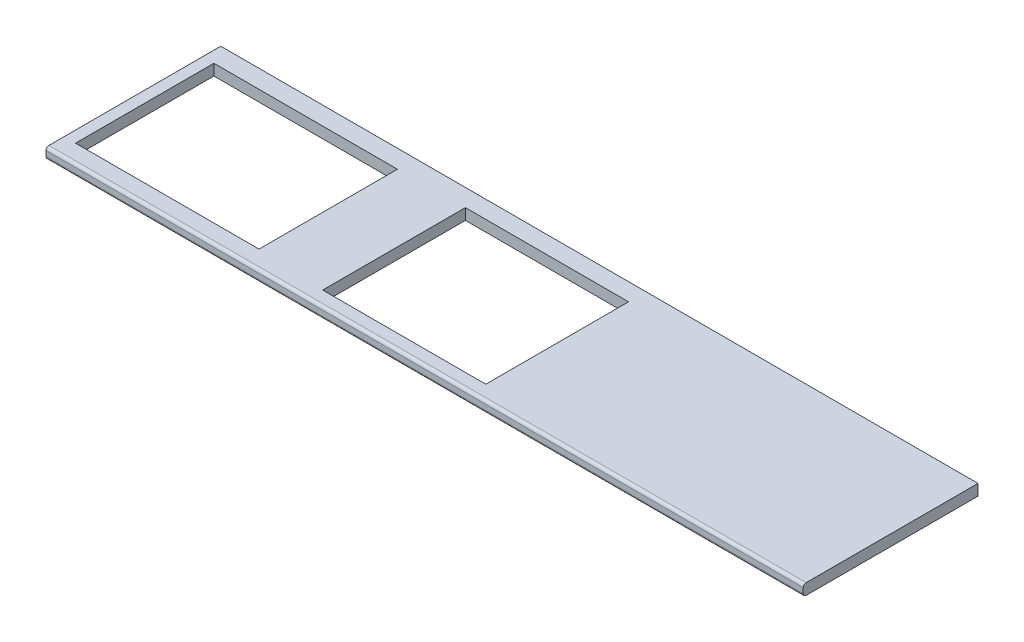
ISO-10303-21;
HEADER;
FILE_DESCRIPTION(('STEP AP214'),'2;1');
FILE_NAME('part.step','',(''),(''),'','','');
FILE_SCHEMA(('AUTOMOTIVE_DESIGN { 1 0 10303 214 1 1 1 1 }'));
ENDSEC;
DATA;
#1=APPLICATION_CONTEXT('core data for automotive mechanical design processes');
#2=APPLICATION_PROTOCOL_DEFINITION('international standard','automotive_design',2000,#1);
#3=PRODUCT_CONTEXT('',#1,'mechanical');
#4=PRODUCT('Part','Part','',(#3));
#5=PRODUCT_RELATED_PRODUCT_CATEGORY('part','',(#4));
#6=PRODUCT_DEFINITION_FORMATION('','',#4);
#7=PRODUCT_DEFINITION_CONTEXT('part definition',#1,'design');
#8=PRODUCT_DEFINITION('design','',#6,#7);
#9=PRODUCT_DEFINITION_SHAPE('','',#8);
#10=(LENGTH_UNIT() NAMED_UNIT(*) SI_UNIT(.MILLI.,.METRE.));
#11=(NAMED_UNIT(*) PLANE_ANGLE_UNIT() SI_UNIT($,.RADIAN.));
#12=(NAMED_UNIT(*) SI_UNIT($,.STERADIAN.) SOLID_ANGLE_UNIT());
#13=UNCERTAINTY_MEASURE_WITH_UNIT(LENGTH_MEASURE(1.E-05),#10,'distance_accuracy_value','');
#14=(GEOMETRIC_REPRESENTATION_CONTEXT(3) GLOBAL_UNCERTAINTY_ASSIGNED_CONTEXT((#13)) GLOBAL_UNIT_ASSIGNED_CONTEXT((#10,
#11,#12)) REPRESENTATION_CONTEXT('',''));
#15=CARTESIAN_POINT('',(0.,0.,0.));
#16=DIRECTION('',(0.,0.,1.));
#17=DIRECTION('',(1.,0.,0.));
#18=AXIS2_PLACEMENT_3D('',#15,#16,#17);
#19=CARTESIAN_POINT('',(-1300.,38.,300.));
#20=DIRECTION('',(1.,0.,0.));
#21=DIRECTION('',(0.,0.,-1.));
#22=AXIS2_PLACEMENT_3D('',#19,#20,#21);
#23=PLANE('',#22);
#24=DIRECTION('',(0.,0.,1.));
#25=VECTOR('',#24,1.);
#26=CARTESIAN_POINT('',(-1300.,0.,300.));
#27=LINE('',#26,#25);
#28=CARTESIAN_POINT('',(-1300.,0.,-300.));
#29=VERTEX_POINT('',#28);
#30=CARTESIAN_POINT('',(-1300.,0.,290.));
#31=VERTEX_POINT('',#30);
#32=EDGE_CURVE('E205',#29,#31,#27,.T.);
#33=ORIENTED_EDGE('',*,*,#32,.T.);
#34=CARTESIAN_POINT('',(-1300.,10.,290.));
#35=DIRECTION('',(1.,0.,0.));
#36=DIRECTION('',(0.,0.,-1.));
#37=AXIS2_PLACEMENT_3D('',#34,#35,#36);
#38=CIRCLE('',#37,10.);
#39=CARTESIAN_POINT('',(-1300.,10.,300.));
#40=VERTEX_POINT('',#39);
#41=EDGE_CURVE('E43',#31,#40,#38,.F.);
#42=ORIENTED_EDGE('',*,*,#41,.T.);
#43=DIRECTION('',(0.,-1.,0.));
#44=VECTOR('',#43,1.);
#45=CARTESIAN_POINT('',(-1300.,38.,300.));
#46=LINE('',#45,#44);
#47=CARTESIAN_POINT('',(-1300.,28.,300.));
#48=VERTEX_POINT('',#47);
#49=EDGE_CURVE('E228',#48,#40,#46,.T.);
#50=ORIENTED_EDGE('',*,*,#49,.F.);
#51=CARTESIAN_POINT('',(-1300.,28.,290.));
#52=DIRECTION('',(1.,0.,0.));
#53=DIRECTION('',(0.,0.,-1.));
#54=AXIS2_PLACEMENT_3D('',#51,#52,#53);
#55=CIRCLE('',#54,10.);
#56=CARTESIAN_POINT('',(-1300.,38.,290.));
#57=VERTEX_POINT('',#56);
#58=EDGE_CURVE('E242',#48,#57,#55,.F.);
#59=ORIENTED_EDGE('',*,*,#58,.T.);
#60=DIRECTION('',(0.,0.,1.));
#61=VECTOR('',#60,1.);
#62=CARTESIAN_POINT('',(-1300.,38.,300.));
#63=LINE('',#62,#61);
#64=CARTESIAN_POINT('',(-1300.,38.,-300.));
#65=VERTEX_POINT('',#64);
#66=EDGE_CURVE('E206',#65,#57,#63,.T.);
#67=ORIENTED_EDGE('',*,*,#66,.F.);
#68=DIRECTION('',(0.,-1.,0.));
#69=VECTOR('',#68,1.);
#70=CARTESIAN_POINT('',(-1300.,38.,-300.));
#71=LINE('',#70,#69);
#72=EDGE_CURVE('E214',#65,#29,#71,.T.);
#73=ORIENTED_EDGE('',*,*,#72,.T.);
#74=EDGE_LOOP('',(#33,#42,#50,#59,#67,#73));
#75=FACE_BOUND('',#74,.T.);
#76=ADVANCED_FACE('F35',(#75),#23,.F.);
#77=CARTESIAN_POINT('',(1300.,38.,300.));
#78=DIRECTION('',(0.,0.,-1.));
#79=DIRECTION('',(-1.,0.,0.));
#80=AXIS2_PLACEMENT_3D('',#77,#78,#79);
#81=PLANE('',#80);
#82=ORIENTED_EDGE('',*,*,#49,.T.);
#83=DIRECTION('',(1.,0.,0.));
#84=VECTOR('',#83,1.);
#85=CARTESIAN_POINT('',(1300.,10.,300.));
#86=LINE('',#85,#84);
#87=CARTESIAN_POINT('',(1300.,10.,300.));
#88=VERTEX_POINT('',#87);
#89=EDGE_CURVE('E233',#40,#88,#86,.T.);
#90=ORIENTED_EDGE('',*,*,#89,.T.);
#91=DIRECTION('',(0.,-1.,0.));
#92=VECTOR('',#91,1.);
#93=CARTESIAN_POINT('',(1300.,38.,300.));
#94=LINE('',#93,#92);
#95=CARTESIAN_POINT('',(1300.,28.,300.));
#96=VERTEX_POINT('',#95);
#97=EDGE_CURVE('E225',#96,#88,#94,.T.);
#98=ORIENTED_EDGE('',*,*,#97,.F.);
#99=DIRECTION('',(1.,0.,0.));
#100=VECTOR('',#99,1.);
#101=CARTESIAN_POINT('',(-1300.,28.,300.));
#102=LINE('',#101,#100);
#103=EDGE_CURVE('E231',#96,#48,#102,.F.);
#104=ORIENTED_EDGE('',*,*,#103,.T.);
#105=EDGE_LOOP('',(#82,#90,#98,#104));
#106=FACE_BOUND('',#105,.T.);
#107=ADVANCED_FACE('F252',(#106),#81,.F.);
#108=CARTESIAN_POINT('',(1300.,38.,300.));
#109=DIRECTION('',(-1.,0.,0.));
#110=DIRECTION('',(0.,0.,1.));
#111=AXIS2_PLACEMENT_3D('',#108,#109,#110);
#112=PLANE('',#111);
#113=ORIENTED_EDGE('',*,*,#97,.T.);
#114=CARTESIAN_POINT('',(1300.,10.,290.));
#115=DIRECTION('',(-1.,0.,0.));
#116=DIRECTION('',(0.,0.,1.));
#117=AXIS2_PLACEMENT_3D('',#114,#115,#116);
#118=CIRCLE('',#117,10.);
#119=CARTESIAN_POINT('',(1300.,0.,290.));
#120=VERTEX_POINT('',#119);
#121=EDGE_CURVE('E238',#88,#120,#118,.F.);
#122=ORIENTED_EDGE('',*,*,#121,.T.);
#123=DIRECTION('',(0.,0.,-1.));
#124=VECTOR('',#123,1.);
#125=CARTESIAN_POINT('',(1300.,0.,300.));
#126=LINE('',#125,#124);
#127=CARTESIAN_POINT('',(1300.,0.,-300.));
#128=VERTEX_POINT('',#127);
#129=EDGE_CURVE('E217',#120,#128,#126,.T.);
#130=ORIENTED_EDGE('',*,*,#129,.T.);
#131=DIRECTION('',(0.,-1.,0.));
#132=VECTOR('',#131,1.);
#133=CARTESIAN_POINT('',(1300.,38.,-300.));
#134=LINE('',#133,#132);
#135=CARTESIAN_POINT('',(1300.,38.,-300.));
#136=VERTEX_POINT('',#135);
#137=EDGE_CURVE('E222',#136,#128,#134,.T.);
#138=ORIENTED_EDGE('',*,*,#137,.F.);
#139=DIRECTION('',(0.,0.,-1.));
#140=VECTOR('',#139,1.);
#141=CARTESIAN_POINT('',(1300.,38.,300.));
#142=LINE('',#141,#140);
#143=CARTESIAN_POINT('',(1300.,38.,290.));
#144=VERTEX_POINT('',#143);
#145=EDGE_CURVE('E209',#144,#136,#142,.T.);
#146=ORIENTED_EDGE('',*,*,#145,.F.);
#147=CARTESIAN_POINT('',(1300.,28.,290.));
#148=DIRECTION('',(-1.,0.,0.));
#149=DIRECTION('',(0.,0.,1.));
#150=AXIS2_PLACEMENT_3D('',#147,#148,#149);
#151=CIRCLE('',#150,10.);
#152=EDGE_CURVE('E236',#144,#96,#151,.F.);
#153=ORIENTED_EDGE('',*,*,#152,.T.);
#154=EDGE_LOOP('',(#113,#122,#130,#138,#146,#153));
#155=FACE_BOUND('',#154,.T.);
#156=ADVANCED_FACE('F258',(#155),#112,.F.);
#157=CARTESIAN_POINT('',(1300.,38.,-300.));
#158=DIRECTION('',(0.,0.,1.));
#159=DIRECTION('',(1.,0.,0.));
#160=AXIS2_PLACEMENT_3D('',#157,#158,#159);
#161=PLANE('',#160);
#162=DIRECTION('',(-1.,0.,0.));
#163=VECTOR('',#162,1.);
#164=CARTESIAN_POINT('',(1300.,0.,-300.));
#165=LINE('',#164,#163);
#166=EDGE_CURVE('E210',#128,#29,#165,.T.);
#167=ORIENTED_EDGE('',*,*,#166,.T.);
#168=ORIENTED_EDGE('',*,*,#72,.F.);
#169=DIRECTION('',(-1.,0.,0.));
#170=VECTOR('',#169,1.);
#171=CARTESIAN_POINT('',(1300.,38.,-300.));
#172=LINE('',#171,#170);
#173=EDGE_CURVE('E212',#136,#65,#172,.T.);
#174=ORIENTED_EDGE('',*,*,#173,.F.);
#175=ORIENTED_EDGE('',*,*,#137,.T.);
#176=EDGE_LOOP('',(#167,#168,#174,#175));
#177=FACE_BOUND('',#176,.T.);
#178=ADVANCED_FACE('F264',(#177),#161,.F.);
#179=CARTESIAN_POINT('',(0.,38.,0.));
#180=DIRECTION('',(0.,1.,0.));
#181=DIRECTION('',(0.,0.,1.));
#182=AXIS2_PLACEMENT_3D('',#179,#180,#181);
#183=PLANE('',#182);
#184=DIRECTION('',(0.,0.,-1.));
#185=VECTOR('',#184,1.);
#186=CARTESIAN_POINT('',(160.000000000001,38.,0.));
#187=LINE('',#186,#185);
#188=CARTESIAN_POINT('',(160.000000000001,38.,250.));
#189=VERTEX_POINT('',#188);
#190=CARTESIAN_POINT('',(160.,38.,-240.));
#191=VERTEX_POINT('',#190);
#192=EDGE_CURVE('E141',#189,#191,#187,.T.);
#193=ORIENTED_EDGE('',*,*,#192,.F.);
#194=DIRECTION('',(1.,0.,0.));
#195=VECTOR('',#194,1.);
#196=CARTESIAN_POINT('',(0.,38.,250.));
#197=LINE('',#196,#195);
#198=CARTESIAN_POINT('',(-400.,38.,250.));
#199=VERTEX_POINT('',#198);
#200=EDGE_CURVE('E202',#199,#189,#197,.T.);
#201=ORIENTED_EDGE('',*,*,#200,.F.);
#202=DIRECTION('',(0.,0.,1.));
#203=VECTOR('',#202,1.);
#204=CARTESIAN_POINT('',(-400.,38.,0.));
#205=LINE('',#204,#203);
#206=CARTESIAN_POINT('',(-400.,38.,-240.));
#207=VERTEX_POINT('',#206);
#208=EDGE_CURVE('E200',#207,#199,#205,.T.);
#209=ORIENTED_EDGE('',*,*,#208,.F.);
#210=DIRECTION('',(-1.,0.,0.));
#211=VECTOR('',#210,1.);
#212=CARTESIAN_POINT('',(0.,38.,-240.));
#213=LINE('',#212,#211);
#214=EDGE_CURVE('E198',#191,#207,#213,.T.);
#215=ORIENTED_EDGE('',*,*,#214,.F.);
#216=EDGE_LOOP('',(#193,#201,#209,#215));
#217=FACE_BOUND('',#216,.T.);
#218=DIRECTION('',(0.,0.,-1.));
#219=VECTOR('',#218,1.);
#220=CARTESIAN_POINT('',(-631.,38.,1.47484363902837E-13));
#221=LINE('',#220,#219);
#222=CARTESIAN_POINT('',(-631.,38.,237.5));
#223=VERTEX_POINT('',#222);
#224=CARTESIAN_POINT('',(-631.,38.,-237.5));
#225=VERTEX_POINT('',#224);
#226=EDGE_CURVE('E196',#223,#225,#221,.T.);
#227=ORIENTED_EDGE('',*,*,#226,.F.);
#228=DIRECTION('',(1.,0.,0.));
#229=VECTOR('',#228,1.);
#230=CARTESIAN_POINT('',(0.,38.,237.5));
#231=LINE('',#230,#229);
#232=CARTESIAN_POINT('',(-1261.,38.,237.5));
#233=VERTEX_POINT('',#232);
#234=EDGE_CURVE('E194',#233,#223,#231,.T.);
#235=ORIENTED_EDGE('',*,*,#234,.F.);
#236=DIRECTION('',(0.,0.,1.));
#237=VECTOR('',#236,1.);
#238=CARTESIAN_POINT('',(-1261.,38.,0.));
#239=LINE('',#238,#237);
#240=CARTESIAN_POINT('',(-1261.,38.,-237.5));
#241=VERTEX_POINT('',#240);
#242=EDGE_CURVE('E192',#241,#233,#239,.T.);
#243=ORIENTED_EDGE('',*,*,#242,.F.);
#244=DIRECTION('',(-1.,0.,0.));
#245=VECTOR('',#244,1.);
#246=CARTESIAN_POINT('',(0.,38.,-237.5));
#247=LINE('',#246,#245);
#248=EDGE_CURVE('E168',#225,#241,#247,.T.);
#249=ORIENTED_EDGE('',*,*,#248,.F.);
#250=EDGE_LOOP('',(#227,#235,#243,#249));
#251=FACE_BOUND('',#250,.T.);
#252=ORIENTED_EDGE('',*,*,#66,.T.);
#253=DIRECTION('',(1.,0.,0.));
#254=VECTOR('',#253,1.);
#255=CARTESIAN_POINT('',(1300.,38.,290.));
#256=LINE('',#255,#254);
#257=EDGE_CURVE('E11',#57,#144,#256,.T.);
#258=ORIENTED_EDGE('',*,*,#257,.T.);
#259=ORIENTED_EDGE('',*,*,#145,.T.);
#260=ORIENTED_EDGE('',*,*,#173,.T.);
#261=EDGE_LOOP('',(#252,#258,#259,#260));
#262=FACE_BOUND('',#261,.T.);
#263=ADVANCED_FACE('F269',(#217,#251,#262),#183,.T.);
#264=CARTESIAN_POINT('',(0.,0.,0.));
#265=DIRECTION('',(0.,1.,0.));
#266=DIRECTION('',(0.,0.,1.));
#267=AXIS2_PLACEMENT_3D('',#264,#265,#266);
#268=PLANE('',#267);
#269=DIRECTION('',(1.,0.,0.));
#270=VECTOR('',#269,1.);
#271=CARTESIAN_POINT('',(-400.,0.,250.));
#272=LINE('',#271,#270);
#273=CARTESIAN_POINT('',(-400.,0.,250.));
#274=VERTEX_POINT('',#273);
#275=CARTESIAN_POINT('',(160.000000000001,0.,250.));
#276=VERTEX_POINT('',#275);
#277=EDGE_CURVE('E144',#274,#276,#272,.T.);
#278=ORIENTED_EDGE('',*,*,#277,.T.);
#279=DIRECTION('',(0.,0.,-1.));
#280=VECTOR('',#279,1.);
#281=CARTESIAN_POINT('',(160.,0.,-240.));
#282=LINE('',#281,#280);
#283=CARTESIAN_POINT('',(160.,0.,-240.));
#284=VERTEX_POINT('',#283);
#285=EDGE_CURVE('E138',#276,#284,#282,.T.);
#286=ORIENTED_EDGE('',*,*,#285,.T.);
#287=DIRECTION('',(-1.,0.,0.));
#288=VECTOR('',#287,1.);
#289=CARTESIAN_POINT('',(-400.,0.,-240.));
#290=LINE('',#289,#288);
#291=CARTESIAN_POINT('',(-400.,0.,-240.));
#292=VERTEX_POINT('',#291);
#293=EDGE_CURVE('E148',#284,#292,#290,.T.);
#294=ORIENTED_EDGE('',*,*,#293,.T.);
#295=DIRECTION('',(0.,0.,1.));
#296=VECTOR('',#295,1.);
#297=CARTESIAN_POINT('',(-400.,0.,-240.));
#298=LINE('',#297,#296);
#299=EDGE_CURVE('E153',#292,#274,#298,.T.);
#300=ORIENTED_EDGE('',*,*,#299,.T.);
#301=EDGE_LOOP('',(#278,#286,#294,#300));
#302=FACE_BOUND('',#301,.T.);
#303=DIRECTION('',(1.,0.,0.));
#304=VECTOR('',#303,1.);
#305=CARTESIAN_POINT('',(-1261.,0.,237.5));
#306=LINE('',#305,#304);
#307=CARTESIAN_POINT('',(-1261.,0.,237.5));
#308=VERTEX_POINT('',#307);
#309=CARTESIAN_POINT('',(-631.,0.,237.5));
#310=VERTEX_POINT('',#309);
#311=EDGE_CURVE('E182',#308,#310,#306,.T.);
#312=ORIENTED_EDGE('',*,*,#311,.T.);
#313=DIRECTION('',(0.,0.,-1.));
#314=VECTOR('',#313,1.);
#315=CARTESIAN_POINT('',(-631.,0.,-237.5));
#316=LINE('',#315,#314);
#317=CARTESIAN_POINT('',(-631.,0.,-237.5));
#318=VERTEX_POINT('',#317);
#319=EDGE_CURVE('E173',#310,#318,#316,.T.);
#320=ORIENTED_EDGE('',*,*,#319,.T.);
#321=DIRECTION('',(-1.,0.,0.));
#322=VECTOR('',#321,1.);
#323=CARTESIAN_POINT('',(-1261.,0.,-237.5));
#324=LINE('',#323,#322);
#325=CARTESIAN_POINT('',(-1261.,0.,-237.5));
#326=VERTEX_POINT('',#325);
#327=EDGE_CURVE('E176',#318,#326,#324,.T.);
#328=ORIENTED_EDGE('',*,*,#327,.T.);
#329=DIRECTION('',(0.,0.,1.));
#330=VECTOR('',#329,1.);
#331=CARTESIAN_POINT('',(-1261.,0.,-237.5));
#332=LINE('',#331,#330);
#333=EDGE_CURVE('E179',#326,#308,#332,.T.);
#334=ORIENTED_EDGE('',*,*,#333,.T.);
#335=EDGE_LOOP('',(#312,#320,#328,#334));
#336=FACE_BOUND('',#335,.T.);
#337=ORIENTED_EDGE('',*,*,#129,.F.);
#338=DIRECTION('',(1.,0.,0.));
#339=VECTOR('',#338,1.);
#340=CARTESIAN_POINT('',(0.,0.,290.));
#341=LINE('',#340,#339);
#342=EDGE_CURVE('E240',#120,#31,#341,.F.);
#343=ORIENTED_EDGE('',*,*,#342,.T.);
#344=ORIENTED_EDGE('',*,*,#32,.F.);
#345=ORIENTED_EDGE('',*,*,#166,.F.);
#346=EDGE_LOOP('',(#337,#343,#344,#345));
#347=FACE_BOUND('',#346,.T.);
#348=ADVANCED_FACE('F155',(#302,#336,#347),#268,.F.);
#349=CARTESIAN_POINT('',(1300.,10.,290.));
#350=DIRECTION('',(1.,0.,0.));
#351=DIRECTION('',(0.,0.,-1.));
#352=AXIS2_PLACEMENT_3D('',#349,#350,#351);
#353=CYLINDRICAL_SURFACE('',#352,10.);
#354=ORIENTED_EDGE('',*,*,#41,.F.);
#355=ORIENTED_EDGE('',*,*,#342,.F.);
#356=ORIENTED_EDGE('',*,*,#121,.F.);
#357=ORIENTED_EDGE('',*,*,#89,.F.);
#358=EDGE_LOOP('',(#354,#355,#356,#357));
#359=FACE_BOUND('',#358,.T.);
#360=ADVANCED_FACE('F255',(#359),#353,.T.);
#361=CARTESIAN_POINT('',(0.,28.,290.));
#362=DIRECTION('',(-1.,0.,0.));
#363=DIRECTION('',(0.,0.,1.));
#364=AXIS2_PLACEMENT_3D('',#361,#362,#363);
#365=CYLINDRICAL_SURFACE('',#364,10.);
#366=ORIENTED_EDGE('',*,*,#58,.F.);
#367=ORIENTED_EDGE('',*,*,#103,.F.);
#368=ORIENTED_EDGE('',*,*,#152,.F.);
#369=ORIENTED_EDGE('',*,*,#257,.F.);
#370=EDGE_LOOP('',(#366,#367,#368,#369));
#371=FACE_BOUND('',#370,.T.);
#372=ADVANCED_FACE('F37',(#371),#365,.T.);
#373=CARTESIAN_POINT('',(-631.,0.,-237.5));
#374=DIRECTION('',(1.,0.,0.));
#375=DIRECTION('',(0.,0.,-1.));
#376=AXIS2_PLACEMENT_3D('',#373,#374,#375);
#377=PLANE('',#376);
#378=ORIENTED_EDGE('',*,*,#226,.T.);
#379=DIRECTION('',(0.,1.,0.));
#380=VECTOR('',#379,1.);
#381=CARTESIAN_POINT('',(-631.,0.,-237.5));
#382=LINE('',#381,#380);
#383=EDGE_CURVE('E58',#318,#225,#382,.T.);
#384=ORIENTED_EDGE('',*,*,#383,.F.);
#385=ORIENTED_EDGE('',*,*,#319,.F.);
#386=DIRECTION('',(0.,1.,0.));
#387=VECTOR('',#386,1.);
#388=CARTESIAN_POINT('',(-631.,0.,237.5));
#389=LINE('',#388,#387);
#390=EDGE_CURVE('E158',#310,#223,#389,.T.);
#391=ORIENTED_EDGE('',*,*,#390,.T.);
#392=EDGE_LOOP('',(#378,#384,#385,#391));
#393=FACE_BOUND('',#392,.T.);
#394=ADVANCED_FACE('F273',(#393),#377,.F.);
#395=CARTESIAN_POINT('',(-1261.,0.,237.5));
#396=DIRECTION('',(0.,0.,1.));
#397=DIRECTION('',(1.,0.,0.));
#398=AXIS2_PLACEMENT_3D('',#395,#396,#397);
#399=PLANE('',#398);
#400=ORIENTED_EDGE('',*,*,#234,.T.);
#401=ORIENTED_EDGE('',*,*,#390,.F.);
#402=ORIENTED_EDGE('',*,*,#311,.F.);
#403=DIRECTION('',(0.,1.,0.));
#404=VECTOR('',#403,1.);
#405=CARTESIAN_POINT('',(-1261.,0.,237.5));
#406=LINE('',#405,#404);
#407=EDGE_CURVE('E161',#308,#233,#406,.T.);
#408=ORIENTED_EDGE('',*,*,#407,.T.);
#409=EDGE_LOOP('',(#400,#401,#402,#408));
#410=FACE_BOUND('',#409,.T.);
#411=ADVANCED_FACE('F278',(#410),#399,.F.);
#412=CARTESIAN_POINT('',(-1261.,0.,-237.5));
#413=DIRECTION('',(-1.,0.,0.));
#414=DIRECTION('',(0.,0.,1.));
#415=AXIS2_PLACEMENT_3D('',#412,#413,#414);
#416=PLANE('',#415);
#417=ORIENTED_EDGE('',*,*,#242,.T.);
#418=ORIENTED_EDGE('',*,*,#407,.F.);
#419=ORIENTED_EDGE('',*,*,#333,.F.);
#420=DIRECTION('',(0.,1.,0.));
#421=VECTOR('',#420,1.);
#422=CARTESIAN_POINT('',(-1261.,0.,-237.5));
#423=LINE('',#422,#421);
#424=EDGE_CURVE('E187',#326,#241,#423,.T.);
#425=ORIENTED_EDGE('',*,*,#424,.T.);
#426=EDGE_LOOP('',(#417,#418,#419,#425));
#427=FACE_BOUND('',#426,.T.);
#428=ADVANCED_FACE('F300',(#427),#416,.F.);
#429=CARTESIAN_POINT('',(-1261.,0.,-237.5));
#430=DIRECTION('',(0.,0.,-1.));
#431=DIRECTION('',(-1.,0.,0.));
#432=AXIS2_PLACEMENT_3D('',#429,#430,#431);
#433=PLANE('',#432);
#434=ORIENTED_EDGE('',*,*,#248,.T.);
#435=ORIENTED_EDGE('',*,*,#424,.F.);
#436=ORIENTED_EDGE('',*,*,#327,.F.);
#437=ORIENTED_EDGE('',*,*,#383,.T.);
#438=EDGE_LOOP('',(#434,#435,#436,#437));
#439=FACE_BOUND('',#438,.T.);
#440=ADVANCED_FACE('F297',(#439),#433,.F.);
#441=CARTESIAN_POINT('',(160.,0.,-240.));
#442=DIRECTION('',(1.,0.,0.));
#443=DIRECTION('',(0.,0.,-1.));
#444=AXIS2_PLACEMENT_3D('',#441,#442,#443);
#445=PLANE('',#444);
#446=ORIENTED_EDGE('',*,*,#192,.T.);
#447=DIRECTION('',(0.,1.,0.));
#448=VECTOR('',#447,1.);
#449=CARTESIAN_POINT('',(160.,0.,-240.));
#450=LINE('',#449,#448);
#451=EDGE_CURVE('E50',#284,#191,#450,.T.);
#452=ORIENTED_EDGE('',*,*,#451,.F.);
#453=ORIENTED_EDGE('',*,*,#285,.F.);
#454=DIRECTION('',(0.,1.,0.));
#455=VECTOR('',#454,1.);
#456=CARTESIAN_POINT('',(160.000000000001,0.,250.));
#457=LINE('',#456,#455);
#458=EDGE_CURVE('E166',#276,#189,#457,.T.);
#459=ORIENTED_EDGE('',*,*,#458,.T.);
#460=EDGE_LOOP('',(#446,#452,#453,#459));
#461=FACE_BOUND('',#460,.T.);
#462=ADVANCED_FACE('F135',(#461),#445,.F.);
#463=CARTESIAN_POINT('',(-400.,0.,250.));
#464=DIRECTION('',(0.,0.,1.));
#465=DIRECTION('',(1.,0.,0.));
#466=AXIS2_PLACEMENT_3D('',#463,#464,#465);
#467=PLANE('',#466);
#468=ORIENTED_EDGE('',*,*,#200,.T.);
#469=ORIENTED_EDGE('',*,*,#458,.F.);
#470=ORIENTED_EDGE('',*,*,#277,.F.);
#471=DIRECTION('',(0.,1.,0.));
#472=VECTOR('',#471,1.);
#473=CARTESIAN_POINT('',(-400.,0.,250.));
#474=LINE('',#473,#472);
#475=EDGE_CURVE('E169',#274,#199,#474,.T.);
#476=ORIENTED_EDGE('',*,*,#475,.T.);
#477=EDGE_LOOP('',(#468,#469,#470,#476));
#478=FACE_BOUND('',#477,.T.);
#479=ADVANCED_FACE('F309',(#478),#467,.F.);
#480=CARTESIAN_POINT('',(-400.,0.,-240.));
#481=DIRECTION('',(-1.,0.,0.));
#482=DIRECTION('',(0.,0.,1.));
#483=AXIS2_PLACEMENT_3D('',#480,#481,#482);
#484=PLANE('',#483);
#485=ORIENTED_EDGE('',*,*,#208,.T.);
#486=ORIENTED_EDGE('',*,*,#475,.F.);
#487=ORIENTED_EDGE('',*,*,#299,.F.);
#488=DIRECTION('',(0.,1.,0.));
#489=VECTOR('',#488,1.);
#490=CARTESIAN_POINT('',(-400.,0.,-240.));
#491=LINE('',#490,#489);
#492=EDGE_CURVE('E143',#292,#207,#491,.T.);
#493=ORIENTED_EDGE('',*,*,#492,.T.);
#494=EDGE_LOOP('',(#485,#486,#487,#493));
#495=FACE_BOUND('',#494,.T.);
#496=ADVANCED_FACE('F312',(#495),#484,.F.);
#497=CARTESIAN_POINT('',(-400.,0.,-240.));
#498=DIRECTION('',(0.,0.,-1.));
#499=DIRECTION('',(-1.,0.,0.));
#500=AXIS2_PLACEMENT_3D('',#497,#498,#499);
#501=PLANE('',#500);
#502=ORIENTED_EDGE('',*,*,#214,.T.);
#503=ORIENTED_EDGE('',*,*,#492,.F.);
#504=ORIENTED_EDGE('',*,*,#293,.F.);
#505=ORIENTED_EDGE('',*,*,#451,.T.);
#506=EDGE_LOOP('',(#502,#503,#504,#505));
#507=FACE_BOUND('',#506,.T.);
#508=ADVANCED_FACE('F149',(#507),#501,.F.);
#509=CLOSED_SHELL('',(#76,#107,#156,#178,#263,#348,#360,#372,#394,#411,#428,#440,#462,#479,#496,#508));
#510=MANIFOLD_SOLID_BREP('B2',#509);
#511=ADVANCED_BREP_SHAPE_REPRESENTATION('',(#18,#510),#14);
#512=SHAPE_DEFINITION_REPRESENTATION(#9,#511);
ENDSEC;
END-ISO-10303-21;
